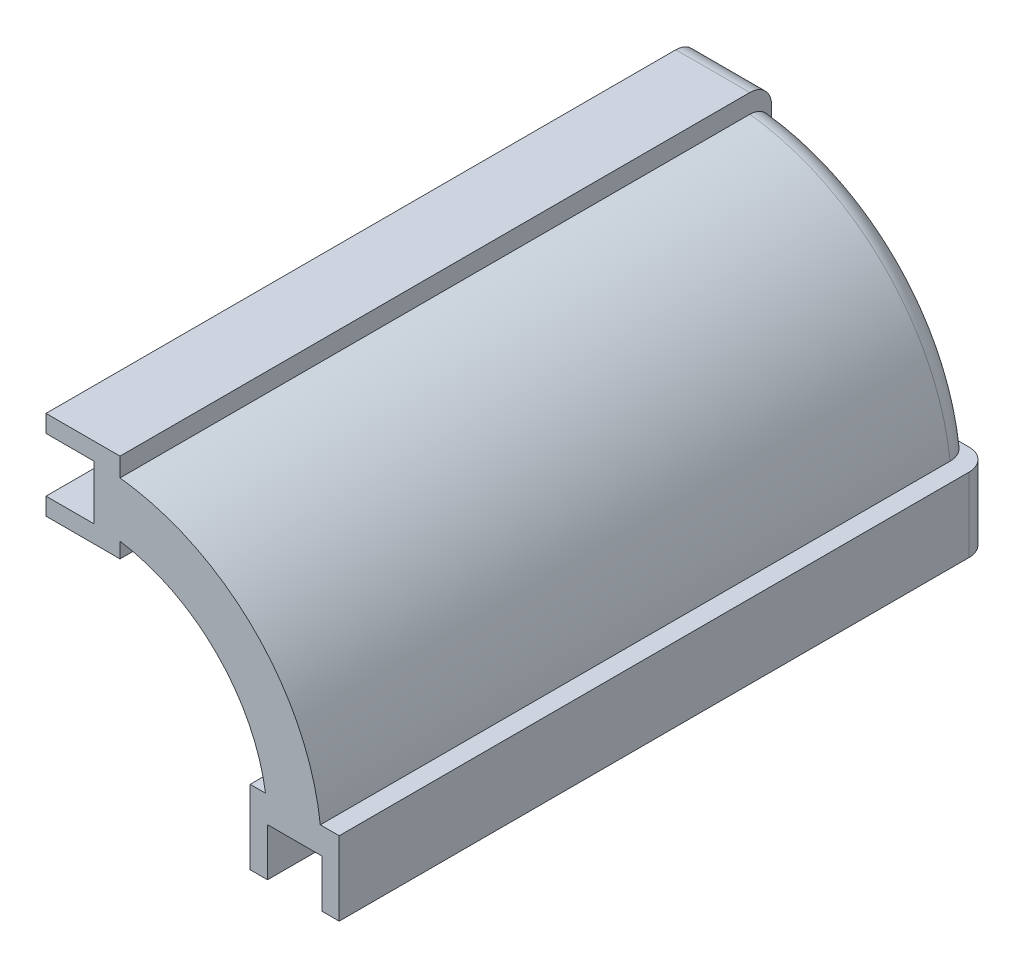
ISO-10303-21;
HEADER;
FILE_DESCRIPTION(('STEP AP214'),'2;1');
FILE_NAME('part.step','',(''),(''),'','','');
FILE_SCHEMA(('AUTOMOTIVE_DESIGN { 1 0 10303 214 1 1 1 1 }'));
ENDSEC;
DATA;
#1=APPLICATION_CONTEXT('core data for automotive mechanical design processes');
#2=APPLICATION_PROTOCOL_DEFINITION('international standard','automotive_design',2000,#1);
#3=PRODUCT_CONTEXT('',#1,'mechanical');
#4=PRODUCT('Part','Part','',(#3));
#5=PRODUCT_RELATED_PRODUCT_CATEGORY('part','',(#4));
#6=PRODUCT_DEFINITION_FORMATION('','',#4);
#7=PRODUCT_DEFINITION_CONTEXT('part definition',#1,'design');
#8=PRODUCT_DEFINITION('design','',#6,#7);
#9=PRODUCT_DEFINITION_SHAPE('','',#8);
#10=(LENGTH_UNIT() NAMED_UNIT(*) SI_UNIT(.MILLI.,.METRE.));
#11=(NAMED_UNIT(*) PLANE_ANGLE_UNIT() SI_UNIT($,.RADIAN.));
#12=(NAMED_UNIT(*) SI_UNIT($,.STERADIAN.) SOLID_ANGLE_UNIT());
#13=UNCERTAINTY_MEASURE_WITH_UNIT(LENGTH_MEASURE(1.E-05),#10,'distance_accuracy_value','');
#14=(GEOMETRIC_REPRESENTATION_CONTEXT(3) GLOBAL_UNCERTAINTY_ASSIGNED_CONTEXT((#13)) GLOBAL_UNIT_ASSIGNED_CONTEXT((#10,
#11,#12)) REPRESENTATION_CONTEXT('',''));
#15=CARTESIAN_POINT('',(0.,0.,0.));
#16=DIRECTION('',(0.,0.,1.));
#17=DIRECTION('',(1.,0.,0.));
#18=AXIS2_PLACEMENT_3D('',#15,#16,#17);
#19=CARTESIAN_POINT('',(0.,0.,150.));
#20=DIRECTION('',(0.,0.,-1.));
#21=DIRECTION('',(-1.,0.,0.));
#22=AXIS2_PLACEMENT_3D('',#19,#20,#21);
#23=CYLINDRICAL_SURFACE('',#22,40.);
#24=DIRECTION('',(0.,0.,-1.));
#25=VECTOR('',#24,1.);
#26=CARTESIAN_POINT('',(6.04096095080742,39.5412037094323,150.));
#27=LINE('',#26,#25);
#28=CARTESIAN_POINT('',(6.04096095080742,39.5412037094323,150.));
#29=VERTEX_POINT('',#28);
#30=CARTESIAN_POINT('',(6.04096095080742,39.5412037094323,5.));
#31=VERTEX_POINT('',#30);
#32=EDGE_CURVE('E316',#29,#31,#27,.T.);
#33=ORIENTED_EDGE('',*,*,#32,.T.);
#34=CARTESIAN_POINT('',(0.,0.,5.));
#35=DIRECTION('',(0.,0.,1.));
#36=DIRECTION('',(1.,0.,0.));
#37=AXIS2_PLACEMENT_3D('',#34,#35,#36);
#38=CIRCLE('',#37,40.);
#39=CARTESIAN_POINT('',(39.5412037094323,6.04096095080742,5.));
#40=VERTEX_POINT('',#39);
#41=EDGE_CURVE('E661',#31,#40,#38,.F.);
#42=ORIENTED_EDGE('',*,*,#41,.T.);
#43=DIRECTION('',(0.,0.,-1.));
#44=VECTOR('',#43,1.);
#45=CARTESIAN_POINT('',(39.5412037094323,6.04096095080742,150.));
#46=LINE('',#45,#44);
#47=CARTESIAN_POINT('',(39.5412037094323,6.04096095080742,150.));
#48=VERTEX_POINT('',#47);
#49=EDGE_CURVE('E269',#40,#48,#46,.F.);
#50=ORIENTED_EDGE('',*,*,#49,.T.);
#51=CARTESIAN_POINT('',(0.,0.,150.));
#52=DIRECTION('',(0.,0.,-1.));
#53=DIRECTION('',(1.,0.,0.));
#54=AXIS2_PLACEMENT_3D('',#51,#52,#53);
#55=CIRCLE('',#54,40.);
#56=EDGE_CURVE('E320',#29,#48,#55,.T.);
#57=ORIENTED_EDGE('',*,*,#56,.F.);
#58=EDGE_LOOP('',(#33,#42,#50,#57));
#59=FACE_BOUND('',#58,.T.);
#60=ADVANCED_FACE('F37',(#59),#23,.F.);
#61=CARTESIAN_POINT('',(40.,0.,150.));
#62=DIRECTION('',(0.,1.,0.));
#63=DIRECTION('',(0.,0.,1.));
#64=AXIS2_PLACEMENT_3D('',#61,#62,#63);
#65=PLANE('',#64);
#66=DIRECTION('',(0.,0.,-1.));
#67=VECTOR('',#66,1.);
#68=CARTESIAN_POINT('',(40.,0.,150.));
#69=LINE('',#68,#67);
#70=CARTESIAN_POINT('',(40.,0.,150.));
#71=VERTEX_POINT('',#70);
#72=CARTESIAN_POINT('',(40.,0.,0.101020514433645));
#73=VERTEX_POINT('',#72);
#74=EDGE_CURVE('E340',#71,#73,#69,.T.);
#75=ORIENTED_EDGE('',*,*,#74,.T.);
#76=CARTESIAN_POINT('',(41.,0.,5.));
#77=DIRECTION('',(0.,1.,0.));
#78=DIRECTION('',(0.,0.,1.));
#79=AXIS2_PLACEMENT_3D('',#76,#77,#78);
#80=CIRCLE('',#79,5.);
#81=CARTESIAN_POINT('',(41.,0.,0.));
#82=VERTEX_POINT('',#81);
#83=EDGE_CURVE('E11',#73,#82,#80,.F.);
#84=ORIENTED_EDGE('',*,*,#83,.T.);
#85=DIRECTION('',(1.,0.,0.));
#86=VECTOR('',#85,1.);
#87=CARTESIAN_POINT('',(40.,0.,0.));
#88=LINE('',#87,#86);
#89=CARTESIAN_POINT('',(51.5,0.,0.));
#90=VERTEX_POINT('',#89);
#91=EDGE_CURVE('E319',#82,#90,#88,.T.);
#92=ORIENTED_EDGE('',*,*,#91,.T.);
#93=CARTESIAN_POINT('',(51.5,0.,5.));
#94=DIRECTION('',(0.,1.,0.));
#95=DIRECTION('',(0.,0.,1.));
#96=AXIS2_PLACEMENT_3D('',#93,#94,#95);
#97=CIRCLE('',#96,5.);
#98=CARTESIAN_POINT('',(52.5,0.,0.101020514433642));
#99=VERTEX_POINT('',#98);
#100=EDGE_CURVE('E708',#90,#99,#97,.F.);
#101=ORIENTED_EDGE('',*,*,#100,.T.);
#102=DIRECTION('',(0.,0.,-1.));
#103=VECTOR('',#102,1.);
#104=CARTESIAN_POINT('',(52.5,0.,150.));
#105=LINE('',#104,#103);
#106=CARTESIAN_POINT('',(52.5,0.,150.));
#107=VERTEX_POINT('',#106);
#108=EDGE_CURVE('E338',#107,#99,#105,.T.);
#109=ORIENTED_EDGE('',*,*,#108,.F.);
#110=DIRECTION('',(1.,0.,0.));
#111=VECTOR('',#110,1.);
#112=CARTESIAN_POINT('',(40.,0.,150.));
#113=LINE('',#112,#111);
#114=EDGE_CURVE('E231',#71,#107,#113,.T.);
#115=ORIENTED_EDGE('',*,*,#114,.F.);
#116=EDGE_LOOP('',(#75,#84,#92,#101,#109,#115));
#117=FACE_BOUND('',#116,.T.);
#118=ADVANCED_FACE('F415',(#117),#65,.F.);
#119=CARTESIAN_POINT('',(0.,0.,150.));
#120=DIRECTION('',(0.,0.,-1.));
#121=DIRECTION('',(-1.,0.,0.));
#122=AXIS2_PLACEMENT_3D('',#119,#120,#121);
#123=CYLINDRICAL_SURFACE('',#122,52.5);
#124=DIRECTION('',(0.,0.,-1.));
#125=VECTOR('',#124,1.);
#126=CARTESIAN_POINT('',(52.1512875276423,6.04096095080742,150.));
#127=LINE('',#126,#125);
#128=CARTESIAN_POINT('',(52.1512875276423,6.04096095080742,150.));
#129=VERTEX_POINT('',#128);
#130=CARTESIAN_POINT('',(52.1512875276423,6.04096095080742,5.));
#131=VERTEX_POINT('',#130);
#132=EDGE_CURVE('E257',#129,#131,#127,.T.);
#133=ORIENTED_EDGE('',*,*,#132,.T.);
#134=CARTESIAN_POINT('',(0.,0.,5.));
#135=DIRECTION('',(0.,0.,1.));
#136=DIRECTION('',(1.,0.,0.));
#137=AXIS2_PLACEMENT_3D('',#134,#135,#136);
#138=CIRCLE('',#137,52.5);
#139=CARTESIAN_POINT('',(6.04096095080742,52.1512875276423,5.));
#140=VERTEX_POINT('',#139);
#141=EDGE_CURVE('E342',#131,#140,#138,.T.);
#142=ORIENTED_EDGE('',*,*,#141,.T.);
#143=DIRECTION('',(0.,0.,-1.));
#144=VECTOR('',#143,1.);
#145=CARTESIAN_POINT('',(6.04096095080742,52.1512875276423,150.));
#146=LINE('',#145,#144);
#147=CARTESIAN_POINT('',(6.04096095080742,52.1512875276423,150.));
#148=VERTEX_POINT('',#147);
#149=EDGE_CURVE('E300',#140,#148,#146,.F.);
#150=ORIENTED_EDGE('',*,*,#149,.T.);
#151=CARTESIAN_POINT('',(0.,0.,150.));
#152=DIRECTION('',(0.,0.,1.));
#153=DIRECTION('',(1.,0.,0.));
#154=AXIS2_PLACEMENT_3D('',#151,#152,#153);
#155=CIRCLE('',#154,52.5);
#156=EDGE_CURVE('E324',#129,#148,#155,.T.);
#157=ORIENTED_EDGE('',*,*,#156,.F.);
#158=EDGE_LOOP('',(#133,#142,#150,#157));
#159=FACE_BOUND('',#158,.T.);
#160=ADVANCED_FACE('F420',(#159),#123,.T.);
#161=CARTESIAN_POINT('',(0.,40.,150.));
#162=DIRECTION('',(1.,0.,0.));
#163=DIRECTION('',(0.,0.,-1.));
#164=AXIS2_PLACEMENT_3D('',#161,#162,#163);
#165=PLANE('',#164);
#166=DIRECTION('',(0.,-1.,0.));
#167=VECTOR('',#166,1.);
#168=CARTESIAN_POINT('',(0.,40.,0.));
#169=LINE('',#168,#167);
#170=CARTESIAN_POINT('',(0.,51.5,0.));
#171=VERTEX_POINT('',#170);
#172=CARTESIAN_POINT('',(0.,41.,0.));
#173=VERTEX_POINT('',#172);
#174=EDGE_CURVE('E322',#171,#173,#169,.T.);
#175=ORIENTED_EDGE('',*,*,#174,.T.);
#176=CARTESIAN_POINT('',(0.,41.,5.));
#177=DIRECTION('',(1.,0.,0.));
#178=DIRECTION('',(0.,0.,-1.));
#179=AXIS2_PLACEMENT_3D('',#176,#177,#178);
#180=CIRCLE('',#179,5.);
#181=CARTESIAN_POINT('',(0.,40.,0.101020514433642));
#182=VERTEX_POINT('',#181);
#183=EDGE_CURVE('E724',#173,#182,#180,.F.);
#184=ORIENTED_EDGE('',*,*,#183,.T.);
#185=DIRECTION('',(0.,0.,-1.));
#186=VECTOR('',#185,1.);
#187=CARTESIAN_POINT('',(0.,40.,150.));
#188=LINE('',#187,#186);
#189=CARTESIAN_POINT('',(0.,40.,150.));
#190=VERTEX_POINT('',#189);
#191=EDGE_CURVE('E329',#190,#182,#188,.T.);
#192=ORIENTED_EDGE('',*,*,#191,.F.);
#193=DIRECTION('',(0.,-1.,0.));
#194=VECTOR('',#193,1.);
#195=CARTESIAN_POINT('',(0.,40.,150.));
#196=LINE('',#195,#194);
#197=CARTESIAN_POINT('',(0.,52.5,150.));
#198=VERTEX_POINT('',#197);
#199=EDGE_CURVE('E327',#198,#190,#196,.T.);
#200=ORIENTED_EDGE('',*,*,#199,.F.);
#201=DIRECTION('',(0.,0.,-1.));
#202=VECTOR('',#201,1.);
#203=CARTESIAN_POINT('',(0.,52.5,150.));
#204=LINE('',#203,#202);
#205=CARTESIAN_POINT('',(0.,52.5,0.101020514433641));
#206=VERTEX_POINT('',#205);
#207=EDGE_CURVE('E335',#198,#206,#204,.T.);
#208=ORIENTED_EDGE('',*,*,#207,.T.);
#209=CARTESIAN_POINT('',(0.,51.5,5.));
#210=DIRECTION('',(1.,0.,0.));
#211=DIRECTION('',(0.,0.,-1.));
#212=AXIS2_PLACEMENT_3D('',#209,#210,#211);
#213=CIRCLE('',#212,5.);
#214=EDGE_CURVE('E713',#206,#171,#213,.F.);
#215=ORIENTED_EDGE('',*,*,#214,.T.);
#216=EDGE_LOOP('',(#175,#184,#192,#200,#208,#215));
#217=FACE_BOUND('',#216,.T.);
#218=ADVANCED_FACE('F426',(#217),#165,.F.);
#219=CARTESIAN_POINT('',(0.,0.,150.));
#220=DIRECTION('',(0.,0.,1.));
#221=DIRECTION('',(1.,0.,0.));
#222=AXIS2_PLACEMENT_3D('',#219,#220,#221);
#223=PLANE('',#222);
#224=ORIENTED_EDGE('',*,*,#56,.T.);
#225=DIRECTION('',(1.,0.,0.));
#226=VECTOR('',#225,1.);
#227=CARTESIAN_POINT('',(56.5,6.04096095080742,150.));
#228=LINE('',#227,#226);
#229=CARTESIAN_POINT('',(36.,6.04096095080742,150.));
#230=VERTEX_POINT('',#229);
#231=EDGE_CURVE('E252',#230,#48,#228,.T.);
#232=ORIENTED_EDGE('',*,*,#231,.F.);
#233=DIRECTION('',(0.,1.,0.));
#234=VECTOR('',#233,1.);
#235=CARTESIAN_POINT('',(36.,6.04096095080742,150.));
#236=LINE('',#235,#234);
#237=CARTESIAN_POINT('',(36.,-11.,150.));
#238=VERTEX_POINT('',#237);
#239=EDGE_CURVE('E248',#238,#230,#236,.T.);
#240=ORIENTED_EDGE('',*,*,#239,.F.);
#241=DIRECTION('',(-1.,0.,0.));
#242=VECTOR('',#241,1.);
#243=CARTESIAN_POINT('',(40.,-11.,150.));
#244=LINE('',#243,#242);
#245=CARTESIAN_POINT('',(40.,-11.,150.));
#246=VERTEX_POINT('',#245);
#247=EDGE_CURVE('E245',#246,#238,#244,.T.);
#248=ORIENTED_EDGE('',*,*,#247,.F.);
#249=DIRECTION('',(0.,-1.,0.));
#250=VECTOR('',#249,1.);
#251=CARTESIAN_POINT('',(40.,0.,150.));
#252=LINE('',#251,#250);
#253=EDGE_CURVE('E233',#71,#246,#252,.T.);
#254=ORIENTED_EDGE('',*,*,#253,.F.);
#255=ORIENTED_EDGE('',*,*,#114,.T.);
#256=DIRECTION('',(0.,1.,0.));
#257=VECTOR('',#256,1.);
#258=CARTESIAN_POINT('',(52.5,-11.,150.));
#259=LINE('',#258,#257);
#260=CARTESIAN_POINT('',(52.5,-11.,150.));
#261=VERTEX_POINT('',#260);
#262=EDGE_CURVE('E213',#261,#107,#259,.T.);
#263=ORIENTED_EDGE('',*,*,#262,.F.);
#264=DIRECTION('',(-1.,0.,0.));
#265=VECTOR('',#264,1.);
#266=CARTESIAN_POINT('',(52.5,-11.,150.));
#267=LINE('',#266,#265);
#268=CARTESIAN_POINT('',(56.5,-11.,150.));
#269=VERTEX_POINT('',#268);
#270=EDGE_CURVE('E227',#269,#261,#267,.T.);
#271=ORIENTED_EDGE('',*,*,#270,.F.);
#272=DIRECTION('',(0.,-1.,0.));
#273=VECTOR('',#272,1.);
#274=CARTESIAN_POINT('',(56.5,-11.,150.));
#275=LINE('',#274,#273);
#276=CARTESIAN_POINT('',(56.5,6.04096095080742,150.));
#277=VERTEX_POINT('',#276);
#278=EDGE_CURVE('E220',#277,#269,#275,.T.);
#279=ORIENTED_EDGE('',*,*,#278,.F.);
#280=EDGE_CURVE('E251',#129,#277,#228,.T.);
#281=ORIENTED_EDGE('',*,*,#280,.F.);
#282=ORIENTED_EDGE('',*,*,#156,.T.);
#283=DIRECTION('',(0.,-1.,0.));
#284=VECTOR('',#283,1.);
#285=CARTESIAN_POINT('',(6.04096095080742,56.5,150.));
#286=LINE('',#285,#284);
#287=CARTESIAN_POINT('',(6.04096095080742,56.5,150.));
#288=VERTEX_POINT('',#287);
#289=EDGE_CURVE('E277',#288,#148,#286,.T.);
#290=ORIENTED_EDGE('',*,*,#289,.F.);
#291=DIRECTION('',(1.,0.,0.));
#292=VECTOR('',#291,1.);
#293=CARTESIAN_POINT('',(-11.,56.5,150.));
#294=LINE('',#293,#292);
#295=CARTESIAN_POINT('',(-11.,56.5,150.));
#296=VERTEX_POINT('',#295);
#297=EDGE_CURVE('E272',#296,#288,#294,.T.);
#298=ORIENTED_EDGE('',*,*,#297,.F.);
#299=DIRECTION('',(0.,1.,0.));
#300=VECTOR('',#299,1.);
#301=CARTESIAN_POINT('',(-11.,52.5,150.));
#302=LINE('',#301,#300);
#303=CARTESIAN_POINT('',(-11.,52.5,150.));
#304=VERTEX_POINT('',#303);
#305=EDGE_CURVE('E292',#304,#296,#302,.T.);
#306=ORIENTED_EDGE('',*,*,#305,.F.);
#307=DIRECTION('',(-1.,0.,0.));
#308=VECTOR('',#307,1.);
#309=CARTESIAN_POINT('',(-11.,52.5,150.));
#310=LINE('',#309,#308);
#311=EDGE_CURVE('E289',#198,#304,#310,.T.);
#312=ORIENTED_EDGE('',*,*,#311,.F.);
#313=ORIENTED_EDGE('',*,*,#199,.T.);
#314=DIRECTION('',(1.,0.,0.));
#315=VECTOR('',#314,1.);
#316=CARTESIAN_POINT('',(0.,40.,150.));
#317=LINE('',#316,#315);
#318=CARTESIAN_POINT('',(-11.,40.,150.));
#319=VERTEX_POINT('',#318);
#320=EDGE_CURVE('E286',#319,#190,#317,.T.);
#321=ORIENTED_EDGE('',*,*,#320,.F.);
#322=DIRECTION('',(0.,1.,0.));
#323=VECTOR('',#322,1.);
#324=CARTESIAN_POINT('',(-11.,40.,150.));
#325=LINE('',#324,#323);
#326=CARTESIAN_POINT('',(-11.,36.,150.));
#327=VERTEX_POINT('',#326);
#328=EDGE_CURVE('E283',#327,#319,#325,.T.);
#329=ORIENTED_EDGE('',*,*,#328,.F.);
#330=DIRECTION('',(-1.,0.,0.));
#331=VECTOR('',#330,1.);
#332=CARTESIAN_POINT('',(6.04096095080742,36.,150.));
#333=LINE('',#332,#331);
#334=CARTESIAN_POINT('',(6.04096095080742,36.,150.));
#335=VERTEX_POINT('',#334);
#336=EDGE_CURVE('E280',#335,#327,#333,.T.);
#337=ORIENTED_EDGE('',*,*,#336,.F.);
#338=EDGE_CURVE('E275',#29,#335,#286,.T.);
#339=ORIENTED_EDGE('',*,*,#338,.F.);
#340=EDGE_LOOP('',(#224,#232,#240,#248,#254,#255,#263,#271,#279,#281,#282,#290,#298,#306,#312,
#313,#321,#329,#337,#339));
#341=FACE_BOUND('',#340,.T.);
#342=ADVANCED_FACE('F225',(#341),#223,.T.);
#343=CARTESIAN_POINT('',(0.,0.,0.));
#344=DIRECTION('',(0.,0.,1.));
#345=DIRECTION('',(1.,0.,0.));
#346=AXIS2_PLACEMENT_3D('',#343,#344,#345);
#347=PLANE('',#346);
#348=ORIENTED_EDGE('',*,*,#91,.F.);
#349=DIRECTION('',(0.,1.,0.));
#350=VECTOR('',#349,1.);
#351=CARTESIAN_POINT('',(41.,6.04096095080743,0.));
#352=LINE('',#351,#350);
#353=CARTESIAN_POINT('',(41.,6.04096095080742,0.));
#354=VERTEX_POINT('',#353);
#355=EDGE_CURVE('E685',#82,#354,#352,.T.);
#356=ORIENTED_EDGE('',*,*,#355,.T.);
#357=DIRECTION('',(1.,0.,0.));
#358=VECTOR('',#357,1.);
#359=CARTESIAN_POINT('',(56.5,6.04096095080742,0.));
#360=LINE('',#359,#358);
#361=CARTESIAN_POINT('',(44.5926764255166,6.04096095080742,0.));
#362=VERTEX_POINT('',#361);
#363=EDGE_CURVE('E238',#354,#362,#360,.T.);
#364=ORIENTED_EDGE('',*,*,#363,.T.);
#365=CARTESIAN_POINT('',(0.,0.,0.));
#366=DIRECTION('',(0.,0.,1.));
#367=DIRECTION('',(1.,0.,0.));
#368=AXIS2_PLACEMENT_3D('',#365,#366,#367);
#369=CIRCLE('',#368,45.);
#370=CARTESIAN_POINT('',(6.04096095080742,44.5926764255166,0.));
#371=VERTEX_POINT('',#370);
#372=EDGE_CURVE('E663',#362,#371,#369,.T.);
#373=ORIENTED_EDGE('',*,*,#372,.T.);
#374=DIRECTION('',(0.,-1.,0.));
#375=VECTOR('',#374,1.);
#376=CARTESIAN_POINT('',(6.04096095080742,56.5,0.));
#377=LINE('',#376,#375);
#378=CARTESIAN_POINT('',(6.04096095080742,41.,0.));
#379=VERTEX_POINT('',#378);
#380=EDGE_CURVE('E271',#371,#379,#377,.T.);
#381=ORIENTED_EDGE('',*,*,#380,.T.);
#382=DIRECTION('',(-1.,0.,0.));
#383=VECTOR('',#382,1.);
#384=CARTESIAN_POINT('',(-11.,41.,0.));
#385=LINE('',#384,#383);
#386=EDGE_CURVE('E709',#379,#173,#385,.T.);
#387=ORIENTED_EDGE('',*,*,#386,.T.);
#388=ORIENTED_EDGE('',*,*,#174,.F.);
#389=DIRECTION('',(1.,0.,0.));
#390=VECTOR('',#389,1.);
#391=CARTESIAN_POINT('',(6.04096095080742,51.5,0.));
#392=LINE('',#391,#390);
#393=CARTESIAN_POINT('',(6.04096095080742,51.5,0.));
#394=VERTEX_POINT('',#393);
#395=EDGE_CURVE('E386',#171,#394,#392,.T.);
#396=ORIENTED_EDGE('',*,*,#395,.T.);
#397=CARTESIAN_POINT('',(6.04096095080742,47.1142949728723,0.));
#398=VERTEX_POINT('',#397);
#399=EDGE_CURVE('E276',#394,#398,#377,.T.);
#400=ORIENTED_EDGE('',*,*,#399,.T.);
#401=CARTESIAN_POINT('',(0.,0.,0.));
#402=DIRECTION('',(0.,0.,1.));
#403=DIRECTION('',(1.,0.,0.));
#404=AXIS2_PLACEMENT_3D('',#401,#402,#403);
#405=CIRCLE('',#404,47.5);
#406=CARTESIAN_POINT('',(47.1142949728723,6.04096095080742,0.));
#407=VERTEX_POINT('',#406);
#408=EDGE_CURVE('E345',#398,#407,#405,.F.);
#409=ORIENTED_EDGE('',*,*,#408,.T.);
#410=CARTESIAN_POINT('',(51.5,6.04096095080742,0.));
#411=VERTEX_POINT('',#410);
#412=EDGE_CURVE('E240',#407,#411,#360,.T.);
#413=ORIENTED_EDGE('',*,*,#412,.T.);
#414=DIRECTION('',(0.,-1.,0.));
#415=VECTOR('',#414,1.);
#416=CARTESIAN_POINT('',(51.5,-11.,0.));
#417=LINE('',#416,#415);
#418=EDGE_CURVE('E706',#411,#90,#417,.T.);
#419=ORIENTED_EDGE('',*,*,#418,.T.);
#420=EDGE_LOOP('',(#348,#356,#364,#373,#381,#387,#388,#396,#400,#409,#413,#419));
#421=FACE_BOUND('',#420,.T.);
#422=ADVANCED_FACE('F431',(#421),#347,.F.);
#423=CARTESIAN_POINT('',(6.04096095080742,36.,150.));
#424=DIRECTION('',(0.,-1.,0.));
#425=DIRECTION('',(0.,0.,-1.));
#426=AXIS2_PLACEMENT_3D('',#423,#424,#425);
#427=PLANE('',#426);
#428=DIRECTION('',(0.,0.,-1.));
#429=VECTOR('',#428,1.);
#430=CARTESIAN_POINT('',(-11.,36.,150.));
#431=LINE('',#430,#429);
#432=CARTESIAN_POINT('',(-11.,36.,5.));
#433=VERTEX_POINT('',#432);
#434=EDGE_CURVE('E307',#327,#433,#431,.T.);
#435=ORIENTED_EDGE('',*,*,#434,.T.);
#436=DIRECTION('',(-1.,0.,0.));
#437=VECTOR('',#436,1.);
#438=CARTESIAN_POINT('',(6.04096095080742,36.,5.));
#439=LINE('',#438,#437);
#440=CARTESIAN_POINT('',(6.04096095080742,36.,5.));
#441=VERTEX_POINT('',#440);
#442=EDGE_CURVE('E680',#433,#441,#439,.F.);
#443=ORIENTED_EDGE('',*,*,#442,.T.);
#444=DIRECTION('',(0.,0.,-1.));
#445=VECTOR('',#444,1.);
#446=CARTESIAN_POINT('',(6.04096095080742,36.,150.));
#447=LINE('',#446,#445);
#448=EDGE_CURVE('E310',#335,#441,#447,.T.);
#449=ORIENTED_EDGE('',*,*,#448,.F.);
#450=ORIENTED_EDGE('',*,*,#336,.T.);
#451=EDGE_LOOP('',(#435,#443,#449,#450));
#452=FACE_BOUND('',#451,.T.);
#453=ADVANCED_FACE('F374',(#452),#427,.T.);
#454=CARTESIAN_POINT('',(-11.,40.,150.));
#455=DIRECTION('',(-1.,0.,0.));
#456=DIRECTION('',(0.,0.,1.));
#457=AXIS2_PLACEMENT_3D('',#454,#455,#456);
#458=PLANE('',#457);
#459=DIRECTION('',(0.,0.,-1.));
#460=VECTOR('',#459,1.);
#461=CARTESIAN_POINT('',(-11.,40.,150.));
#462=LINE('',#461,#460);
#463=CARTESIAN_POINT('',(-11.,40.,0.101020514433644));
#464=VERTEX_POINT('',#463);
#465=EDGE_CURVE('E304',#319,#464,#462,.T.);
#466=ORIENTED_EDGE('',*,*,#465,.T.);
#467=CARTESIAN_POINT('',(-11.,41.,5.));
#468=DIRECTION('',(-1.,0.,0.));
#469=DIRECTION('',(0.,0.,1.));
#470=AXIS2_PLACEMENT_3D('',#467,#468,#469);
#471=CIRCLE('',#470,5.);
#472=EDGE_CURVE('E683',#464,#433,#471,.T.);
#473=ORIENTED_EDGE('',*,*,#472,.T.);
#474=ORIENTED_EDGE('',*,*,#434,.F.);
#475=ORIENTED_EDGE('',*,*,#328,.T.);
#476=EDGE_LOOP('',(#466,#473,#474,#475));
#477=FACE_BOUND('',#476,.T.);
#478=ADVANCED_FACE('F452',(#477),#458,.T.);
#479=CARTESIAN_POINT('',(0.,40.,150.));
#480=DIRECTION('',(0.,1.,0.));
#481=DIRECTION('',(0.,0.,1.));
#482=AXIS2_PLACEMENT_3D('',#479,#480,#481);
#483=PLANE('',#482);
#484=ORIENTED_EDGE('',*,*,#191,.T.);
#485=DIRECTION('',(1.,0.,0.));
#486=VECTOR('',#485,1.);
#487=CARTESIAN_POINT('',(0.,40.,0.101020514433651));
#488=LINE('',#487,#486);
#489=EDGE_CURVE('E687',#182,#464,#488,.F.);
#490=ORIENTED_EDGE('',*,*,#489,.T.);
#491=ORIENTED_EDGE('',*,*,#465,.F.);
#492=ORIENTED_EDGE('',*,*,#320,.T.);
#493=EDGE_LOOP('',(#484,#490,#491,#492));
#494=FACE_BOUND('',#493,.T.);
#495=ADVANCED_FACE('F372',(#494),#483,.T.);
#496=CARTESIAN_POINT('',(6.04096095080742,56.5,150.));
#497=DIRECTION('',(1.,0.,0.));
#498=DIRECTION('',(0.,0.,-1.));
#499=AXIS2_PLACEMENT_3D('',#496,#497,#498);
#500=PLANE('',#499);
#501=ORIENTED_EDGE('',*,*,#448,.T.);
#502=CARTESIAN_POINT('',(6.04096095080742,41.,5.));
#503=DIRECTION('',(1.,0.,0.));
#504=DIRECTION('',(0.,0.,-1.));
#505=AXIS2_PLACEMENT_3D('',#502,#503,#504);
#506=CIRCLE('',#505,5.);
#507=EDGE_CURVE('E682',#441,#379,#506,.T.);
#508=ORIENTED_EDGE('',*,*,#507,.T.);
#509=ORIENTED_EDGE('',*,*,#380,.F.);
#510=CARTESIAN_POINT('',(6.04096095080742,44.5926764255166,0.));
#511=CARTESIAN_POINT('',(6.04096095080742,44.4496087881308,-1.44551378492032E-05));
#512=CARTESIAN_POINT('',(6.04096095080742,44.3065434513015,0.00602924254243664));
#513=CARTESIAN_POINT('',(6.04096095080742,44.0214325534951,0.0301221743525943));
#514=CARTESIAN_POINT('',(6.04096095080742,43.8793869528825,0.0481709392843391));
#515=CARTESIAN_POINT('',(6.04096095080742,43.597394487456,0.0961504703347627));
#516=CARTESIAN_POINT('',(6.04096095080742,43.457446544998,0.126074902060707));
#517=CARTESIAN_POINT('',(6.04096095080742,43.1805670408339,0.197594385733043));
#518=CARTESIAN_POINT('',(6.04096095080742,43.043635440116,0.239189286643932));
#519=CARTESIAN_POINT('',(6.04096095080742,42.7737148378985,0.333782871880875));
#520=CARTESIAN_POINT('',(6.04096095080742,42.6407272420728,0.386785567755036));
#521=CARTESIAN_POINT('',(6.04096095080742,42.3796498458265,0.503844795059563));
#522=CARTESIAN_POINT('',(6.04096095080742,42.251561868804,0.567905393737767));
#523=CARTESIAN_POINT('',(6.04096095080742,42.0013329386991,0.706587559680802));
#524=CARTESIAN_POINT('',(6.04096095080742,41.8791885931317,0.78120300516065));
#525=CARTESIAN_POINT('',(6.04096095080742,41.6416151685986,0.940537011470195));
#526=CARTESIAN_POINT('',(6.04096095080742,41.5261884222766,1.02525905097226));
#527=CARTESIAN_POINT('',(6.04096095080742,41.3033286383386,1.2038907423242));
#528=CARTESIAN_POINT('',(6.04096095080742,41.1958695000784,1.29776782937149));
#529=CARTESIAN_POINT('',(6.04096095080742,40.9893031591371,1.49429995280007));
#530=CARTESIAN_POINT('',(6.04096095080742,40.8901958776176,1.59695490630321));
#531=CARTESIAN_POINT('',(6.04096095080742,40.701038137545,1.81036363608506));
#532=CARTESIAN_POINT('',(6.04096095080742,40.6109910184337,1.92112037277298));
#533=CARTESIAN_POINT('',(6.04096095080742,40.4407076486395,2.14987377159927));
#534=CARTESIAN_POINT('',(6.04096095080742,40.3604678344164,2.26786778048848));
#535=CARTESIAN_POINT('',(6.04096095080742,40.211038773713,2.50921717300387));
#536=CARTESIAN_POINT('',(6.04096095080742,40.1417582267174,2.63251603112006));
#537=CARTESIAN_POINT('',(6.04096095080742,40.0139534746371,2.88450932308639));
#538=CARTESIAN_POINT('',(6.04096095080742,39.9554251775114,3.01320168130761));
#539=CARTESIAN_POINT('',(6.04096095080742,39.8495653706113,3.27505266444434));
#540=CARTESIAN_POINT('',(6.04096095080742,39.802229210563,3.40820940808033));
#541=CARTESIAN_POINT('',(6.04096095080742,39.7190992406919,3.67803048894134));
#542=CARTESIAN_POINT('',(6.04096095080742,39.683302307113,3.81469386606073));
#543=CARTESIAN_POINT('',(6.04096095080742,39.6161429066285,4.12465995538275));
#544=CARTESIAN_POINT('',(6.04096095080742,39.5880547388608,4.29868179116453));
#545=CARTESIAN_POINT('',(6.04096095080742,39.550575361991,4.64847632850518));
#546=CARTESIAN_POINT('',(6.04096095080742,39.541157748555,4.82424620363079));
#547=CARTESIAN_POINT('',(6.04096095080742,39.5412037094323,5.));
#548=B_SPLINE_CURVE_WITH_KNOTS('',3,(#510,#511,#512,#513,#514,#515,#516,#517,#518,#519,#520,
#521,#522,#523,#524,#525,#526,#527,#528,#529,#530,#531,#532,#533,#534,#535,#536,#537,#538,#539,
#540,#541,#542,#543,#544,#545,#546,#547),.UNSPECIFIED.,.F.,.F.,(4,2,2,2,2,2,2,2,2,2,2,2,2,2,2,2,
2,2,4),(0.,0.429072129404467,0.858127490222234,1.28695430301858,1.71577556633055,
2.14474787162138,2.57387829631091,3.00276083922703,3.43179143104677,3.85934805248157,
4.28690063749167,4.71461023915759,5.14216396514429,5.56594326993523,5.98956095915224,
6.41300232693114,6.83632896947063,7.364122533033,7.89116914464254),.UNSPECIFIED.);
#549=EDGE_CURVE('E380',#371,#31,#548,.T.);
#550=ORIENTED_EDGE('',*,*,#549,.T.);
#551=ORIENTED_EDGE('',*,*,#32,.F.);
#552=ORIENTED_EDGE('',*,*,#338,.T.);
#553=EDGE_LOOP('',(#501,#508,#509,#550,#551,#552));
#554=FACE_BOUND('',#553,.T.);
#555=ADVANCED_FACE('F366',(#554),#500,.T.);
#556=ORIENTED_EDGE('',*,*,#399,.F.);
#557=CARTESIAN_POINT('',(6.04096095080742,51.5,5.));
#558=DIRECTION('',(1.,0.,0.));
#559=DIRECTION('',(0.,0.,-1.));
#560=AXIS2_PLACEMENT_3D('',#557,#558,#559);
#561=CIRCLE('',#560,5.);
#562=CARTESIAN_POINT('',(6.04096095080742,56.5,5.));
#563=VERTEX_POINT('',#562);
#564=EDGE_CURVE('E740',#394,#563,#561,.T.);
#565=ORIENTED_EDGE('',*,*,#564,.T.);
#566=DIRECTION('',(0.,0.,-1.));
#567=VECTOR('',#566,1.);
#568=CARTESIAN_POINT('',(6.04096095080742,56.5,150.));
#569=LINE('',#568,#567);
#570=EDGE_CURVE('E295',#288,#563,#569,.T.);
#571=ORIENTED_EDGE('',*,*,#570,.F.);
#572=ORIENTED_EDGE('',*,*,#289,.T.);
#573=ORIENTED_EDGE('',*,*,#149,.F.);
#574=CARTESIAN_POINT('',(6.04096095080742,52.1512875276423,5.));
#575=CARTESIAN_POINT('',(6.04096095080742,52.1513031742111,4.86006786018856));
#576=CARTESIAN_POINT('',(6.04096095080742,52.1453746104619,4.7201382007512));
#577=CARTESIAN_POINT('',(6.04096095080742,52.1217422514957,4.44128485752872));
#578=CARTESIAN_POINT('',(6.04096095080742,52.1040391638975,4.3023611137978));
#579=CARTESIAN_POINT('',(6.04096095080742,52.0569928414848,4.02663203108004));
#580=CARTESIAN_POINT('',(6.04096095080742,52.0276604639588,3.88982483948078));
#581=CARTESIAN_POINT('',(6.04096095080742,51.9575765676874,3.61916915008827));
#582=CARTESIAN_POINT('',(6.04096095080742,51.9168251622787,3.48532062294377));
#583=CARTESIAN_POINT('',(6.04096095080742,51.8241899658329,3.22149739227884));
#584=CARTESIAN_POINT('',(6.04096095080742,51.7723035234578,3.09152361977654));
#585=CARTESIAN_POINT('',(6.04096095080742,51.657763049687,2.8363531747938));
#586=CARTESIAN_POINT('',(6.04096095080742,51.5951050473389,2.71115828493026));
#587=CARTESIAN_POINT('',(6.04096095080742,51.4595258503797,2.46653760371732));
#588=CARTESIAN_POINT('',(6.04096095080742,51.3866098188288,2.34710895048205));
#589=CARTESIAN_POINT('',(6.04096095080742,51.2309911386518,2.11474433837276));
#590=CARTESIAN_POINT('',(6.04096095080742,51.1482848824401,2.00181079579192));
#591=CARTESIAN_POINT('',(6.04096095080742,50.973497458364,1.7830088966781));
#592=CARTESIAN_POINT('',(6.04096095080742,50.881394540332,1.67715791574013));
#593=CARTESIAN_POINT('',(6.04096095080742,50.6886059152711,1.47351023059974));
#594=CARTESIAN_POINT('',(6.04096095080742,50.5879170327438,1.37571653288681));
#595=CARTESIAN_POINT('',(6.04096095080742,50.378725856929,1.18891536278847));
#596=CARTESIAN_POINT('',(6.04096095080742,50.2702248837508,1.09990641193015));
#597=CARTESIAN_POINT('',(6.04096095080742,50.046127946014,0.93123271795031));
#598=CARTESIAN_POINT('',(6.04096095080742,49.9305294538836,0.85157133343469));
#599=CARTESIAN_POINT('',(6.04096095080742,49.6923353082787,0.7016929980976));
#600=CARTESIAN_POINT('',(6.04096095080742,49.5696998397689,0.631539315336208));
#601=CARTESIAN_POINT('',(6.04096095080742,49.3189826241691,0.501754099290657));
#602=CARTESIAN_POINT('',(6.04096095080742,49.1909008101454,0.442122695368194));
#603=CARTESIAN_POINT('',(6.04096095080742,48.9302422530013,0.333803921794165));
#604=CARTESIAN_POINT('',(6.04096095080742,48.7976672468165,0.285112377417299));
#605=CARTESIAN_POINT('',(6.04096095080742,48.5289632261073,0.198978911196371));
#606=CARTESIAN_POINT('',(6.04096095080742,48.3928349188709,0.161534768828229));
#607=CARTESIAN_POINT('',(6.04096095080742,48.0683170670541,0.0866976229909006));
#608=CARTESIAN_POINT('',(6.04096095080742,47.878767711156,0.0541828753319848));
#609=CARTESIAN_POINT('',(6.04096095080742,47.5928452652118,0.021674518647008));
#610=CARTESIAN_POINT('',(6.04096095080742,47.4973194086512,0.0135490320967323));
#611=CARTESIAN_POINT('',(6.04096095080742,47.3059690152168,0.00271259943092027));
#612=CARTESIAN_POINT('',(6.04096095080742,47.2101445039683,1.20092201660902E-06));
#613=CARTESIAN_POINT('',(6.04096095080742,47.1142949728723,0.));
#614=B_SPLINE_CURVE_WITH_KNOTS('',3,(#574,#575,#576,#577,#578,#579,#580,#581,#582,#583,#584,
#585,#586,#587,#588,#589,#590,#591,#592,#593,#594,#595,#596,#597,#598,#599,#600,#601,#602,#603,
#604,#605,#606,#607,#608,#609,#610,#611,#612,#613),.UNSPECIFIED.,.F.,.F.,(4,2,2,2,2,2,2,2,2,2,2,
2,2,2,2,2,2,2,2,4),(0.,0.419667330579757,0.839309442503741,1.25856068906241,1.67780777459631,
2.09715479706636,2.51665674529221,2.93594830067279,3.3553948439809,3.77583529721381,
4.19643192944338,4.61695765411699,5.03763401513688,5.46098504071537,5.88434127064097,
6.30753566949163,6.7306464639756,7.30618808596964,7.5936723569337,7.88113260512242),.UNSPECIFIED.);
#615=EDGE_CURVE('E348',#140,#398,#614,.T.);
#616=ORIENTED_EDGE('',*,*,#615,.T.);
#617=EDGE_LOOP('',(#556,#565,#571,#572,#573,#616));
#618=FACE_BOUND('',#617,.T.);
#619=ADVANCED_FACE('F371',(#618),#500,.T.);
#620=CARTESIAN_POINT('',(-11.,56.5,150.));
#621=DIRECTION('',(0.,1.,0.));
#622=DIRECTION('',(0.,0.,1.));
#623=AXIS2_PLACEMENT_3D('',#620,#621,#622);
#624=PLANE('',#623);
#625=ORIENTED_EDGE('',*,*,#570,.T.);
#626=DIRECTION('',(1.,0.,0.));
#627=VECTOR('',#626,1.);
#628=CARTESIAN_POINT('',(-11.,56.5,5.));
#629=LINE('',#628,#627);
#630=CARTESIAN_POINT('',(-11.,56.5,5.));
#631=VERTEX_POINT('',#630);
#632=EDGE_CURVE('E741',#563,#631,#629,.F.);
#633=ORIENTED_EDGE('',*,*,#632,.T.);
#634=DIRECTION('',(0.,0.,-1.));
#635=VECTOR('',#634,1.);
#636=CARTESIAN_POINT('',(-11.,56.5,150.));
#637=LINE('',#636,#635);
#638=EDGE_CURVE('E297',#296,#631,#637,.T.);
#639=ORIENTED_EDGE('',*,*,#638,.F.);
#640=ORIENTED_EDGE('',*,*,#297,.T.);
#641=EDGE_LOOP('',(#625,#633,#639,#640));
#642=FACE_BOUND('',#641,.T.);
#643=ADVANCED_FACE('F376',(#642),#624,.T.);
#644=CARTESIAN_POINT('',(-11.,52.5,150.));
#645=DIRECTION('',(-1.,0.,0.));
#646=DIRECTION('',(0.,0.,1.));
#647=AXIS2_PLACEMENT_3D('',#644,#645,#646);
#648=PLANE('',#647);
#649=ORIENTED_EDGE('',*,*,#638,.T.);
#650=CARTESIAN_POINT('',(-11.,51.5,5.));
#651=DIRECTION('',(-1.,0.,0.));
#652=DIRECTION('',(0.,0.,1.));
#653=AXIS2_PLACEMENT_3D('',#650,#651,#652);
#654=CIRCLE('',#653,5.);
#655=CARTESIAN_POINT('',(-11.,52.5,0.101020514433642));
#656=VERTEX_POINT('',#655);
#657=EDGE_CURVE('E742',#631,#656,#654,.T.);
#658=ORIENTED_EDGE('',*,*,#657,.T.);
#659=DIRECTION('',(0.,0.,-1.));
#660=VECTOR('',#659,1.);
#661=CARTESIAN_POINT('',(-11.,52.5,150.));
#662=LINE('',#661,#660);
#663=EDGE_CURVE('E301',#304,#656,#662,.T.);
#664=ORIENTED_EDGE('',*,*,#663,.F.);
#665=ORIENTED_EDGE('',*,*,#305,.T.);
#666=EDGE_LOOP('',(#649,#658,#664,#665));
#667=FACE_BOUND('',#666,.T.);
#668=ADVANCED_FACE('F484',(#667),#648,.T.);
#669=CARTESIAN_POINT('',(-11.,52.5,150.));
#670=DIRECTION('',(0.,-1.,0.));
#671=DIRECTION('',(1.,0.,0.));
#672=AXIS2_PLACEMENT_3D('',#669,#670,#671);
#673=PLANE('',#672);
#674=ORIENTED_EDGE('',*,*,#663,.T.);
#675=DIRECTION('',(-1.,0.,0.));
#676=VECTOR('',#675,1.);
#677=CARTESIAN_POINT('',(-11.,52.5,0.101020514433645));
#678=LINE('',#677,#676);
#679=EDGE_CURVE('E746',#656,#206,#678,.F.);
#680=ORIENTED_EDGE('',*,*,#679,.T.);
#681=ORIENTED_EDGE('',*,*,#207,.F.);
#682=ORIENTED_EDGE('',*,*,#311,.T.);
#683=EDGE_LOOP('',(#674,#680,#681,#682));
#684=FACE_BOUND('',#683,.T.);
#685=ADVANCED_FACE('F491',(#684),#673,.T.);
#686=CARTESIAN_POINT('',(52.5,-11.,150.));
#687=DIRECTION('',(0.,-1.,0.));
#688=DIRECTION('',(1.,0.,0.));
#689=AXIS2_PLACEMENT_3D('',#686,#687,#688);
#690=PLANE('',#689);
#691=DIRECTION('',(0.,0.,-1.));
#692=VECTOR('',#691,1.);
#693=CARTESIAN_POINT('',(52.5,-11.,150.));
#694=LINE('',#693,#692);
#695=CARTESIAN_POINT('',(52.5,-11.,0.101020514433643));
#696=VERTEX_POINT('',#695);
#697=EDGE_CURVE('E209',#261,#696,#694,.T.);
#698=ORIENTED_EDGE('',*,*,#697,.T.);
#699=CARTESIAN_POINT('',(51.5,-11.,5.));
#700=DIRECTION('',(0.,-1.,0.));
#701=DIRECTION('',(1.,0.,0.));
#702=AXIS2_PLACEMENT_3D('',#699,#700,#701);
#703=CIRCLE('',#702,5.);
#704=CARTESIAN_POINT('',(56.5,-11.,5.));
#705=VERTEX_POINT('',#704);
#706=EDGE_CURVE('E718',#696,#705,#703,.T.);
#707=ORIENTED_EDGE('',*,*,#706,.T.);
#708=DIRECTION('',(0.,0.,-1.));
#709=VECTOR('',#708,1.);
#710=CARTESIAN_POINT('',(56.5,-11.,150.));
#711=LINE('',#710,#709);
#712=EDGE_CURVE('E237',#269,#705,#711,.T.);
#713=ORIENTED_EDGE('',*,*,#712,.F.);
#714=ORIENTED_EDGE('',*,*,#270,.T.);
#715=EDGE_LOOP('',(#698,#707,#713,#714));
#716=FACE_BOUND('',#715,.T.);
#717=ADVANCED_FACE('F235',(#716),#690,.T.);
#718=CARTESIAN_POINT('',(56.5,-11.,150.));
#719=DIRECTION('',(1.,0.,0.));
#720=DIRECTION('',(0.,1.,0.));
#721=AXIS2_PLACEMENT_3D('',#718,#719,#720);
#722=PLANE('',#721);
#723=ORIENTED_EDGE('',*,*,#712,.T.);
#724=DIRECTION('',(0.,-1.,0.));
#725=VECTOR('',#724,1.);
#726=CARTESIAN_POINT('',(56.5,6.04096095080742,5.));
#727=LINE('',#726,#725);
#728=CARTESIAN_POINT('',(56.5,6.04096095080742,5.));
#729=VERTEX_POINT('',#728);
#730=EDGE_CURVE('E720',#705,#729,#727,.F.);
#731=ORIENTED_EDGE('',*,*,#730,.T.);
#732=DIRECTION('',(0.,0.,-1.));
#733=VECTOR('',#732,1.);
#734=CARTESIAN_POINT('',(56.5,6.04096095080742,150.));
#735=LINE('',#734,#733);
#736=EDGE_CURVE('E258',#277,#729,#735,.T.);
#737=ORIENTED_EDGE('',*,*,#736,.F.);
#738=ORIENTED_EDGE('',*,*,#278,.T.);
#739=EDGE_LOOP('',(#723,#731,#737,#738));
#740=FACE_BOUND('',#739,.T.);
#741=ADVANCED_FACE('F506',(#740),#722,.T.);
#742=CARTESIAN_POINT('',(52.5,-11.,150.));
#743=DIRECTION('',(-1.,0.,0.));
#744=DIRECTION('',(0.,-1.,0.));
#745=AXIS2_PLACEMENT_3D('',#742,#743,#744);
#746=PLANE('',#745);
#747=ORIENTED_EDGE('',*,*,#108,.T.);
#748=DIRECTION('',(0.,1.,0.));
#749=VECTOR('',#748,1.);
#750=CARTESIAN_POINT('',(52.5,0.,0.101020514433647));
#751=LINE('',#750,#749);
#752=EDGE_CURVE('E215',#99,#696,#751,.F.);
#753=ORIENTED_EDGE('',*,*,#752,.T.);
#754=ORIENTED_EDGE('',*,*,#697,.F.);
#755=ORIENTED_EDGE('',*,*,#262,.T.);
#756=EDGE_LOOP('',(#747,#753,#754,#755));
#757=FACE_BOUND('',#756,.T.);
#758=ADVANCED_FACE('F212',(#757),#746,.T.);
#759=CARTESIAN_POINT('',(56.5,6.04096095080742,150.));
#760=DIRECTION('',(0.,1.,0.));
#761=DIRECTION('',(0.,0.,1.));
#762=AXIS2_PLACEMENT_3D('',#759,#760,#761);
#763=PLANE('',#762);
#764=ORIENTED_EDGE('',*,*,#736,.T.);
#765=CARTESIAN_POINT('',(51.5,6.04096095080742,5.));
#766=DIRECTION('',(0.,1.,0.));
#767=DIRECTION('',(0.,0.,1.));
#768=AXIS2_PLACEMENT_3D('',#765,#766,#767);
#769=CIRCLE('',#768,5.);
#770=EDGE_CURVE('E722',#729,#411,#769,.T.);
#771=ORIENTED_EDGE('',*,*,#770,.T.);
#772=ORIENTED_EDGE('',*,*,#412,.F.);
#773=CARTESIAN_POINT('',(47.1142949728723,6.04096095080742,0.));
#774=CARTESIAN_POINT('',(47.2567771912122,6.04096095080742,-1.45799453867418E-05));
#775=CARTESIAN_POINT('',(47.3992581022428,6.04096095080742,0.00599124672342123));
#776=CARTESIAN_POINT('',(47.6832092048151,6.04096095080742,0.029944220445521));
#777=CARTESIAN_POINT('',(47.8246794217022,6.04096095080742,0.0478910669808223));
#778=CARTESIAN_POINT('',(48.1055375240028,6.04096095080742,0.0956145699535908));
#779=CARTESIAN_POINT('',(48.2449264227761,6.04096095080742,0.125385260827534));
#780=CARTESIAN_POINT('',(48.5207012969313,6.04096095080742,0.196554021163077));
#781=CARTESIAN_POINT('',(48.6570873243188,6.04096095080742,0.237951889087475));
#782=CARTESIAN_POINT('',(48.9259412259583,6.04096095080742,0.332118125741107));
#783=CARTESIAN_POINT('',(49.0584074209611,6.04096095080742,0.384891289665979));
#784=CARTESIAN_POINT('',(49.3184571582739,6.04096095080742,0.50146009278294));
#785=CARTESIAN_POINT('',(49.4460388824271,6.04096095080742,0.565259788600796));
#786=CARTESIAN_POINT('',(49.6952689352321,6.04096095080742,0.703387714987677));
#787=CARTESIAN_POINT('',(49.816920814736,6.04096095080742,0.777709538041399));
#788=CARTESIAN_POINT('',(50.0535300542276,6.04096095080742,0.936423208566083));
#789=CARTESIAN_POINT('',(50.1684850873652,6.04096095080742,1.02081852543048));
#790=CARTESIAN_POINT('',(50.3903246276793,6.04096095080742,1.19867649086228));
#791=CARTESIAN_POINT('',(50.4972423151732,6.04096095080742,1.29209775440503));
#792=CARTESIAN_POINT('',(50.7027792835911,6.04096095080742,1.48766156330167));
#793=CARTESIAN_POINT('',(50.8013986232121,6.04096095080742,1.58980404695705));
#794=CARTESIAN_POINT('',(50.9896491223682,6.04096095080742,1.80212972430595));
#795=CARTESIAN_POINT('',(51.079276905776,6.04096095080742,1.91231591160006));
#796=CARTESIAN_POINT('',(51.2488080131961,6.04096095080742,2.13987056464434));
#797=CARTESIAN_POINT('',(51.3287148103752,6.04096095080742,2.25723644253857));
#798=CARTESIAN_POINT('',(51.4777597133338,6.04096095080742,2.49756131041544));
#799=CARTESIAN_POINT('',(51.5469644564447,6.04096095080742,2.62047897409616));
#800=CARTESIAN_POINT('',(51.6746900031437,6.04096095080742,2.87168662540888));
#801=CARTESIAN_POINT('',(51.7332148009237,6.04096095080742,2.99997458244648));
#802=CARTESIAN_POINT('',(51.8391592781123,6.04096095080742,3.26100739803347));
#803=CARTESIAN_POINT('',(51.8865830115381,6.04096095080742,3.39375060924828));
#804=CARTESIAN_POINT('',(51.9699875945442,6.04096095080742,3.66272879309758));
#805=CARTESIAN_POINT('',(52.005971406214,6.04096095080742,3.79896285197363));
#806=CARTESIAN_POINT('',(52.0743712708277,6.04096095080742,4.11111965301767));
#807=CARTESIAN_POINT('',(52.1032140753814,6.04096095080742,4.28784639044413));
#808=CARTESIAN_POINT('',(52.1320549289213,6.04096095080742,4.55427941894401));
#809=CARTESIAN_POINT('',(52.1392646478047,6.04096095080742,4.64326767086887));
#810=CARTESIAN_POINT('',(52.1488804392174,6.04096095080742,4.82149712966967));
#811=CARTESIAN_POINT('',(52.1512868468807,6.04096095080742,4.91073831846274));
#812=CARTESIAN_POINT('',(52.1512875276423,6.04096095080742,5.00000000000001));
#813=B_SPLINE_CURVE_WITH_KNOTS('',3,(#773,#774,#775,#776,#777,#778,#779,#780,#781,#782,#783,
#784,#785,#786,#787,#788,#789,#790,#791,#792,#793,#794,#795,#796,#797,#798,#799,#800,#801,#802,
#803,#804,#805,#806,#807,#808,#809,#810,#811,#812),.UNSPECIFIED.,.F.,.F.,(4,2,2,2,2,2,2,2,2,2,2,
2,2,2,2,2,2,2,2,4),(0.,0.427318391081959,0.854626028308005,1.28171834646579,1.70880326216647,
2.1360685665686,2.56349139641807,2.99065505514455,3.41796625934002,3.84340361663473,
4.26883796441094,4.69443146001349,5.1198724478836,5.54254733039129,5.9650638113293,
6.38742575116499,6.8096782414055,7.34569511931549,7.61342552770521,7.88113725549827),.UNSPECIFIED.);
#814=EDGE_CURVE('E356',#407,#131,#813,.T.);
#815=ORIENTED_EDGE('',*,*,#814,.T.);
#816=ORIENTED_EDGE('',*,*,#132,.F.);
#817=ORIENTED_EDGE('',*,*,#280,.T.);
#818=EDGE_LOOP('',(#764,#771,#772,#815,#816,#817));
#819=FACE_BOUND('',#818,.T.);
#820=ADVANCED_FACE('F520',(#819),#763,.T.);
#821=ORIENTED_EDGE('',*,*,#363,.F.);
#822=CARTESIAN_POINT('',(41.,6.04096095080742,5.));
#823=DIRECTION('',(0.,1.,0.));
#824=DIRECTION('',(0.,0.,1.));
#825=AXIS2_PLACEMENT_3D('',#822,#823,#824);
#826=CIRCLE('',#825,5.);
#827=CARTESIAN_POINT('',(36.,6.04096095080742,5.));
#828=VERTEX_POINT('',#827);
#829=EDGE_CURVE('E693',#354,#828,#826,.T.);
#830=ORIENTED_EDGE('',*,*,#829,.T.);
#831=DIRECTION('',(0.,0.,-1.));
#832=VECTOR('',#831,1.);
#833=CARTESIAN_POINT('',(36.,6.04096095080742,150.));
#834=LINE('',#833,#832);
#835=EDGE_CURVE('E261',#230,#828,#834,.T.);
#836=ORIENTED_EDGE('',*,*,#835,.F.);
#837=ORIENTED_EDGE('',*,*,#231,.T.);
#838=ORIENTED_EDGE('',*,*,#49,.F.);
#839=CARTESIAN_POINT('',(39.5412037094323,6.04096095080742,5.));
#840=CARTESIAN_POINT('',(39.5411874419869,6.04096095080742,4.86049814033387));
#841=CARTESIAN_POINT('',(39.5471089883084,6.04096095080742,4.72099912059819));
#842=CARTESIAN_POINT('',(39.5707097968994,6.04096095080742,4.44300911608279));
#843=CARTESIAN_POINT('',(39.5883881953878,6.04096095080742,4.30451805800332));
#844=CARTESIAN_POINT('',(39.6353590043653,6.04096095080742,4.02967665119191));
#845=CARTESIAN_POINT('',(39.6646386298145,6.04096095080742,3.89332411710754));
#846=CARTESIAN_POINT('',(39.734582958416,6.04096095080742,3.6235727844774));
#847=CARTESIAN_POINT('',(39.7752475793262,6.04096095080742,3.49017396460231));
#848=CARTESIAN_POINT('',(39.8676623687062,6.04096095080742,3.22724854050623));
#849=CARTESIAN_POINT('',(39.919414400045,6.04096095080742,3.09772259116441));
#850=CARTESIAN_POINT('',(40.0336310396376,6.04096095080742,2.84342657542318));
#851=CARTESIAN_POINT('',(40.0960995991175,6.04096095080742,2.7186582840043));
#852=CARTESIAN_POINT('',(40.2312395504947,6.04096095080742,2.47485025108187));
#853=CARTESIAN_POINT('',(40.3039063052843,6.04096095080742,2.35580793883215));
#854=CARTESIAN_POINT('',(40.4589571263278,6.04096095080742,2.1241666746541));
#855=CARTESIAN_POINT('',(40.5413447864826,6.04096095080742,2.01157012877323));
#856=CARTESIAN_POINT('',(40.7156514407201,6.04096095080742,1.793088354596));
#857=CARTESIAN_POINT('',(40.8076161057687,6.04096095080742,1.68723956440866));
#858=CARTESIAN_POINT('',(41.0000992080469,6.04096095080742,1.48355524176669));
#859=CARTESIAN_POINT('',(41.1006208079236,6.04096095080742,1.38572269856951));
#860=CARTESIAN_POINT('',(41.3094498439071,6.04096095080742,1.19878863933052));
#861=CARTESIAN_POINT('',(41.4177560851392,6.04096095080742,1.10968578829728));
#862=CARTESIAN_POINT('',(41.6414380488126,6.04096095080742,0.940759516082361));
#863=CARTESIAN_POINT('',(41.7568162970693,6.04096095080742,0.860939440145495));
#864=CARTESIAN_POINT('',(41.9950253207949,6.04096095080742,0.71036864104618));
#865=CARTESIAN_POINT('',(42.1179209358642,6.04096095080742,0.639720475044494));
#866=CARTESIAN_POINT('',(42.369241443103,6.04096095080742,0.508924531627227));
#867=CARTESIAN_POINT('',(42.4976686408658,6.04096095080742,0.448781186520866));
#868=CARTESIAN_POINT('',(42.7590050963214,6.04096095080742,0.339476072369796));
#869=CARTESIAN_POINT('',(42.8919108723997,6.04096095080742,0.290305989576352));
#870=CARTESIAN_POINT('',(43.1613584394178,6.04096095080742,0.203214405323337));
#871=CARTESIAN_POINT('',(43.2979008040877,6.04096095080742,0.165294690383053));
#872=CARTESIAN_POINT('',(43.6253639840161,6.04096095080742,0.0889236662304575));
#873=CARTESIAN_POINT('',(43.8175144696523,6.04096095080742,0.0555827671181894));
#874=CARTESIAN_POINT('',(44.107407229231,6.04096095080742,0.0222394466881327));
#875=CARTESIAN_POINT('',(44.2042711095666,6.04096095080742,0.0139030193780351));
#876=CARTESIAN_POINT('',(44.3983067594833,6.04096095080742,0.00278423508007886));
#877=CARTESIAN_POINT('',(44.4954784950182,6.04096095080742,1.28402110290503E-06));
#878=CARTESIAN_POINT('',(44.5926764255166,6.04096095080742,0.));
#879=B_SPLINE_CURVE_WITH_KNOTS('',3,(#839,#840,#841,#842,#843,#844,#845,#846,#847,#848,#849,
#850,#851,#852,#853,#854,#855,#856,#857,#858,#859,#860,#861,#862,#863,#864,#865,#866,#867,#868,
#869,#870,#871,#872,#873,#874,#875,#876,#877,#878),.UNSPECIFIED.,.F.,.F.,(4,2,2,2,2,2,2,2,2,2,2,
2,2,2,2,2,2,2,2,4),(0.,0.418375826196033,0.836720917535122,1.25460625160866,1.672488567069,
2.09044114883485,2.50854816387105,2.92646567839917,3.34453818758189,3.76470461198828,
4.18502701002862,4.60528502944805,5.02569403150769,5.45045971005476,5.87540417971074,
6.30002559441817,6.72471440148408,7.3083156647657,7.59984857923181,7.89135030592246),.UNSPECIFIED.);
#880=EDGE_CURVE('E387',#40,#362,#879,.T.);
#881=ORIENTED_EDGE('',*,*,#880,.T.);
#882=EDGE_LOOP('',(#821,#830,#836,#837,#838,#881));
#883=FACE_BOUND('',#882,.T.);
#884=ADVANCED_FACE('F527',(#883),#763,.T.);
#885=CARTESIAN_POINT('',(36.,6.04096095080742,150.));
#886=DIRECTION('',(-1.,0.,0.));
#887=DIRECTION('',(0.,-1.,0.));
#888=AXIS2_PLACEMENT_3D('',#885,#886,#887);
#889=PLANE('',#888);
#890=ORIENTED_EDGE('',*,*,#835,.T.);
#891=DIRECTION('',(0.,1.,0.));
#892=VECTOR('',#891,1.);
#893=CARTESIAN_POINT('',(36.,-11.,5.));
#894=LINE('',#893,#892);
#895=CARTESIAN_POINT('',(36.,-11.,5.));
#896=VERTEX_POINT('',#895);
#897=EDGE_CURVE('E695',#828,#896,#894,.F.);
#898=ORIENTED_EDGE('',*,*,#897,.T.);
#899=DIRECTION('',(0.,0.,-1.));
#900=VECTOR('',#899,1.);
#901=CARTESIAN_POINT('',(36.,-11.,150.));
#902=LINE('',#901,#900);
#903=EDGE_CURVE('E264',#238,#896,#902,.T.);
#904=ORIENTED_EDGE('',*,*,#903,.F.);
#905=ORIENTED_EDGE('',*,*,#239,.T.);
#906=EDGE_LOOP('',(#890,#898,#904,#905));
#907=FACE_BOUND('',#906,.T.);
#908=ADVANCED_FACE('F534',(#907),#889,.T.);
#909=CARTESIAN_POINT('',(40.,-11.,150.));
#910=DIRECTION('',(0.,-1.,0.));
#911=DIRECTION('',(0.,0.,-1.));
#912=AXIS2_PLACEMENT_3D('',#909,#910,#911);
#913=PLANE('',#912);
#914=ORIENTED_EDGE('',*,*,#903,.T.);
#915=CARTESIAN_POINT('',(41.,-11.,5.));
#916=DIRECTION('',(0.,-1.,0.));
#917=DIRECTION('',(0.,0.,-1.));
#918=AXIS2_PLACEMENT_3D('',#915,#916,#917);
#919=CIRCLE('',#918,5.);
#920=CARTESIAN_POINT('',(40.,-11.,0.101020514433642));
#921=VERTEX_POINT('',#920);
#922=EDGE_CURVE('E59',#896,#921,#919,.T.);
#923=ORIENTED_EDGE('',*,*,#922,.T.);
#924=DIRECTION('',(0.,0.,-1.));
#925=VECTOR('',#924,1.);
#926=CARTESIAN_POINT('',(40.,-11.,150.));
#927=LINE('',#926,#925);
#928=EDGE_CURVE('E219',#246,#921,#927,.T.);
#929=ORIENTED_EDGE('',*,*,#928,.F.);
#930=ORIENTED_EDGE('',*,*,#247,.T.);
#931=EDGE_LOOP('',(#914,#923,#929,#930));
#932=FACE_BOUND('',#931,.T.);
#933=ADVANCED_FACE('F541',(#932),#913,.T.);
#934=CARTESIAN_POINT('',(40.,0.,150.));
#935=DIRECTION('',(1.,0.,0.));
#936=DIRECTION('',(0.,1.,0.));
#937=AXIS2_PLACEMENT_3D('',#934,#935,#936);
#938=PLANE('',#937);
#939=ORIENTED_EDGE('',*,*,#928,.T.);
#940=DIRECTION('',(0.,-1.,0.));
#941=VECTOR('',#940,1.);
#942=CARTESIAN_POINT('',(40.,-11.,0.10102051443365));
#943=LINE('',#942,#941);
#944=EDGE_CURVE('E45',#921,#73,#943,.F.);
#945=ORIENTED_EDGE('',*,*,#944,.T.);
#946=ORIENTED_EDGE('',*,*,#74,.F.);
#947=ORIENTED_EDGE('',*,*,#253,.T.);
#948=EDGE_LOOP('',(#939,#945,#946,#947));
#949=FACE_BOUND('',#948,.T.);
#950=ADVANCED_FACE('F549',(#949),#938,.T.);
#951=CARTESIAN_POINT('',(0.,0.,5.));
#952=DIRECTION('',(0.,0.,1.));
#953=DIRECTION('',(1.,0.,0.));
#954=AXIS2_PLACEMENT_3D('',#951,#952,#953);
#955=TOROIDAL_SURFACE('',#954,47.5,5.);
#956=ORIENTED_EDGE('',*,*,#814,.F.);
#957=ORIENTED_EDGE('',*,*,#408,.F.);
#958=ORIENTED_EDGE('',*,*,#615,.F.);
#959=ORIENTED_EDGE('',*,*,#141,.F.);
#960=EDGE_LOOP('',(#956,#957,#958,#959));
#961=FACE_BOUND('',#960,.T.);
#962=ADVANCED_FACE('F362',(#961),#955,.T.);
#963=CARTESIAN_POINT('',(0.,0.,5.));
#964=DIRECTION('',(0.,0.,1.));
#965=DIRECTION('',(1.,0.,0.));
#966=AXIS2_PLACEMENT_3D('',#963,#964,#965);
#967=TOROIDAL_SURFACE('',#966,45.,5.);
#968=ORIENTED_EDGE('',*,*,#549,.F.);
#969=ORIENTED_EDGE('',*,*,#372,.F.);
#970=ORIENTED_EDGE('',*,*,#880,.F.);
#971=ORIENTED_EDGE('',*,*,#41,.F.);
#972=EDGE_LOOP('',(#968,#969,#970,#971));
#973=FACE_BOUND('',#972,.T.);
#974=ADVANCED_FACE('F393',(#973),#967,.T.);
#975=CARTESIAN_POINT('',(0.,51.5,5.));
#976=DIRECTION('',(-1.,0.,0.));
#977=DIRECTION('',(0.,0.,1.));
#978=AXIS2_PLACEMENT_3D('',#975,#976,#977);
#979=CYLINDRICAL_SURFACE('',#978,5.);
#980=ORIENTED_EDGE('',*,*,#657,.F.);
#981=ORIENTED_EDGE('',*,*,#632,.F.);
#982=ORIENTED_EDGE('',*,*,#564,.F.);
#983=ORIENTED_EDGE('',*,*,#395,.F.);
#984=ORIENTED_EDGE('',*,*,#214,.F.);
#985=ORIENTED_EDGE('',*,*,#679,.F.);
#986=EDGE_LOOP('',(#980,#981,#982,#983,#984,#985));
#987=FACE_BOUND('',#986,.T.);
#988=ADVANCED_FACE('F397',(#987),#979,.T.);
#989=CARTESIAN_POINT('',(51.5,0.,5.));
#990=DIRECTION('',(0.,1.,0.));
#991=DIRECTION('',(-1.,0.,0.));
#992=AXIS2_PLACEMENT_3D('',#989,#990,#991);
#993=CYLINDRICAL_SURFACE('',#992,5.);
#994=ORIENTED_EDGE('',*,*,#770,.F.);
#995=ORIENTED_EDGE('',*,*,#730,.F.);
#996=ORIENTED_EDGE('',*,*,#706,.F.);
#997=ORIENTED_EDGE('',*,*,#752,.F.);
#998=ORIENTED_EDGE('',*,*,#100,.F.);
#999=ORIENTED_EDGE('',*,*,#418,.F.);
#1000=EDGE_LOOP('',(#994,#995,#996,#997,#998,#999));
#1001=FACE_BOUND('',#1000,.T.);
#1002=ADVANCED_FACE('F402',(#1001),#993,.T.);
#1003=CARTESIAN_POINT('',(0.,41.,5.));
#1004=DIRECTION('',(1.,0.,0.));
#1005=DIRECTION('',(0.,0.,-1.));
#1006=AXIS2_PLACEMENT_3D('',#1003,#1004,#1005);
#1007=CYLINDRICAL_SURFACE('',#1006,5.);
#1008=ORIENTED_EDGE('',*,*,#507,.F.);
#1009=ORIENTED_EDGE('',*,*,#442,.F.);
#1010=ORIENTED_EDGE('',*,*,#472,.F.);
#1011=ORIENTED_EDGE('',*,*,#489,.F.);
#1012=ORIENTED_EDGE('',*,*,#183,.F.);
#1013=ORIENTED_EDGE('',*,*,#386,.F.);
#1014=EDGE_LOOP('',(#1008,#1009,#1010,#1011,#1012,#1013));
#1015=FACE_BOUND('',#1014,.T.);
#1016=ADVANCED_FACE('F405',(#1015),#1007,.T.);
#1017=CARTESIAN_POINT('',(41.,0.,5.));
#1018=DIRECTION('',(0.,-1.,0.));
#1019=DIRECTION('',(1.,0.,0.));
#1020=AXIS2_PLACEMENT_3D('',#1017,#1018,#1019);
#1021=CYLINDRICAL_SURFACE('',#1020,5.);
#1022=ORIENTED_EDGE('',*,*,#922,.F.);
#1023=ORIENTED_EDGE('',*,*,#897,.F.);
#1024=ORIENTED_EDGE('',*,*,#829,.F.);
#1025=ORIENTED_EDGE('',*,*,#355,.F.);
#1026=ORIENTED_EDGE('',*,*,#83,.F.);
#1027=ORIENTED_EDGE('',*,*,#944,.F.);
#1028=EDGE_LOOP('',(#1022,#1023,#1024,#1025,#1026,#1027));
#1029=FACE_BOUND('',#1028,.T.);
#1030=ADVANCED_FACE('F39',(#1029),#1021,.T.);
#1031=CLOSED_SHELL('',(#60,#118,#160,#218,#342,#422,#453,#478,#495,#555,#619,#643,#668,#685,
#717,#741,#758,#820,#884,#908,#933,#950,#962,#974,#988,#1002,#1016,#1030));
#1032=MANIFOLD_SOLID_BREP('B2',#1031);
#1033=ADVANCED_BREP_SHAPE_REPRESENTATION('',(#18,#1032),#14);
#1034=SHAPE_DEFINITION_REPRESENTATION(#9,#1033);
ENDSEC;
END-ISO-10303-21;
